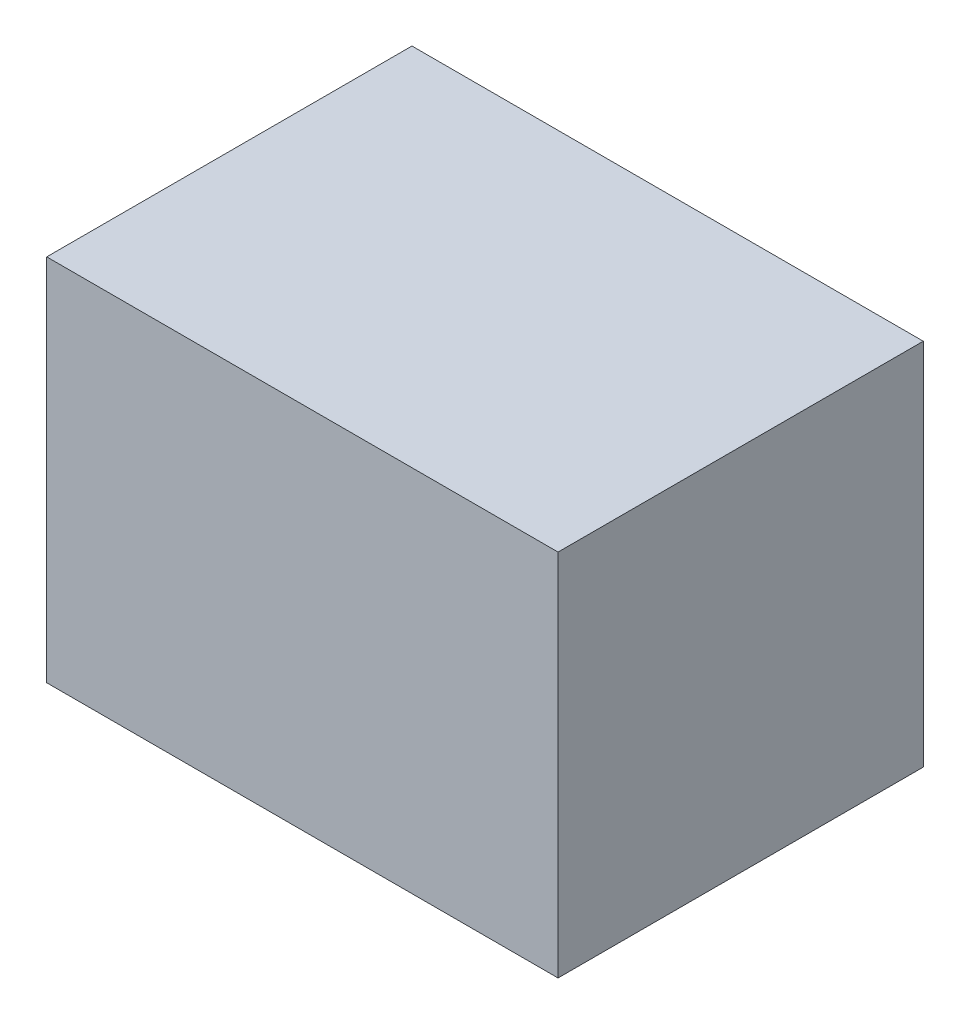
ISO-10303-21;
HEADER;
FILE_DESCRIPTION(('STEP AP214'),'2;1');
FILE_NAME('part.step','',(''),(''),'','','');
FILE_SCHEMA(('AUTOMOTIVE_DESIGN { 1 0 10303 214 1 1 1 1 }'));
ENDSEC;
DATA;
#1=APPLICATION_CONTEXT('core data for automotive mechanical design processes');
#2=APPLICATION_PROTOCOL_DEFINITION('international standard','automotive_design',2000,#1);
#3=PRODUCT_CONTEXT('',#1,'mechanical');
#4=PRODUCT('Part','Part','',(#3));
#5=PRODUCT_RELATED_PRODUCT_CATEGORY('part','',(#4));
#6=PRODUCT_DEFINITION_FORMATION('','',#4);
#7=PRODUCT_DEFINITION_CONTEXT('part definition',#1,'design');
#8=PRODUCT_DEFINITION('design','',#6,#7);
#9=PRODUCT_DEFINITION_SHAPE('','',#8);
#10=(LENGTH_UNIT() NAMED_UNIT(*) SI_UNIT(.MILLI.,.METRE.));
#11=(NAMED_UNIT(*) PLANE_ANGLE_UNIT() SI_UNIT($,.RADIAN.));
#12=(NAMED_UNIT(*) SI_UNIT($,.STERADIAN.) SOLID_ANGLE_UNIT());
#13=UNCERTAINTY_MEASURE_WITH_UNIT(LENGTH_MEASURE(1.E-05),#10,'distance_accuracy_value','');
#14=(GEOMETRIC_REPRESENTATION_CONTEXT(3) GLOBAL_UNCERTAINTY_ASSIGNED_CONTEXT((#13)) GLOBAL_UNIT_ASSIGNED_CONTEXT((#10,
#11,#12)) REPRESENTATION_CONTEXT('',''));
#15=CARTESIAN_POINT('',(0.,0.,0.));
#16=DIRECTION('',(0.,0.,1.));
#17=DIRECTION('',(1.,0.,0.));
#18=AXIS2_PLACEMENT_3D('',#15,#16,#17);
#19=CARTESIAN_POINT('',(70.,50.,100.));
#20=DIRECTION('',(-1.,0.,0.));
#21=DIRECTION('',(0.,-1.,0.));
#22=AXIS2_PLACEMENT_3D('',#19,#20,#21);
#23=PLANE('',#22);
#24=DIRECTION('',(0.,1.,0.));
#25=VECTOR('',#24,1.);
#26=CARTESIAN_POINT('',(70.,50.,0.));
#27=LINE('',#26,#25);
#28=CARTESIAN_POINT('',(70.,-50.,0.));
#29=VERTEX_POINT('',#28);
#30=CARTESIAN_POINT('',(70.,51.,0.));
#31=VERTEX_POINT('',#30);
#32=EDGE_CURVE('E88',#29,#31,#27,.T.);
#33=ORIENTED_EDGE('',*,*,#32,.T.);
#34=DIRECTION('',(0.,0.,-1.));
#35=VECTOR('',#34,1.);
#36=CARTESIAN_POINT('',(70.,51.,0.));
#37=LINE('',#36,#35);
#38=CARTESIAN_POINT('',(70.,51.,100.));
#39=VERTEX_POINT('',#38);
#40=EDGE_CURVE('E135',#39,#31,#37,.T.);
#41=ORIENTED_EDGE('',*,*,#40,.F.);
#42=DIRECTION('',(0.,1.,0.));
#43=VECTOR('',#42,1.);
#44=CARTESIAN_POINT('',(70.,50.,100.));
#45=LINE('',#44,#43);
#46=CARTESIAN_POINT('',(70.,-50.,100.));
#47=VERTEX_POINT('',#46);
#48=EDGE_CURVE('E81',#47,#39,#45,.T.);
#49=ORIENTED_EDGE('',*,*,#48,.F.);
#50=DIRECTION('',(0.,0.,-1.));
#51=VECTOR('',#50,1.);
#52=CARTESIAN_POINT('',(70.,-50.,100.));
#53=LINE('',#52,#51);
#54=EDGE_CURVE('E45',#47,#29,#53,.T.);
#55=ORIENTED_EDGE('',*,*,#54,.T.);
#56=EDGE_LOOP('',(#33,#41,#49,#55));
#57=FACE_BOUND('',#56,.T.);
#58=ADVANCED_FACE('F37',(#57),#23,.F.);
#59=CARTESIAN_POINT('',(-70.,50.,100.));
#60=DIRECTION('',(1.,0.,0.));
#61=DIRECTION('',(0.,1.,0.));
#62=AXIS2_PLACEMENT_3D('',#59,#60,#61);
#63=PLANE('',#62);
#64=DIRECTION('',(0.,-1.,0.));
#65=VECTOR('',#64,1.);
#66=CARTESIAN_POINT('',(-70.,50.,0.));
#67=LINE('',#66,#65);
#68=CARTESIAN_POINT('',(-70.,51.,0.));
#69=VERTEX_POINT('',#68);
#70=CARTESIAN_POINT('',(-70.,-50.,0.));
#71=VERTEX_POINT('',#70);
#72=EDGE_CURVE('E82',#69,#71,#67,.T.);
#73=ORIENTED_EDGE('',*,*,#72,.T.);
#74=DIRECTION('',(0.,0.,-1.));
#75=VECTOR('',#74,1.);
#76=CARTESIAN_POINT('',(-70.,-50.,100.));
#77=LINE('',#76,#75);
#78=CARTESIAN_POINT('',(-70.,-50.,100.));
#79=VERTEX_POINT('',#78);
#80=EDGE_CURVE('E11',#79,#71,#77,.T.);
#81=ORIENTED_EDGE('',*,*,#80,.F.);
#82=DIRECTION('',(0.,-1.,0.));
#83=VECTOR('',#82,1.);
#84=CARTESIAN_POINT('',(-70.,50.,100.));
#85=LINE('',#84,#83);
#86=CARTESIAN_POINT('',(-70.,51.,100.));
#87=VERTEX_POINT('',#86);
#88=EDGE_CURVE('E101',#87,#79,#85,.T.);
#89=ORIENTED_EDGE('',*,*,#88,.F.);
#90=DIRECTION('',(0.,0.,1.));
#91=VECTOR('',#90,1.);
#92=CARTESIAN_POINT('',(-70.,51.,0.));
#93=LINE('',#92,#91);
#94=EDGE_CURVE('E140',#69,#87,#93,.T.);
#95=ORIENTED_EDGE('',*,*,#94,.F.);
#96=EDGE_LOOP('',(#73,#81,#89,#95));
#97=FACE_BOUND('',#96,.T.);
#98=ADVANCED_FACE('F152',(#97),#63,.F.);
#99=CARTESIAN_POINT('',(-70.,-50.,100.));
#100=DIRECTION('',(0.,1.,0.));
#101=DIRECTION('',(0.,0.,1.));
#102=AXIS2_PLACEMENT_3D('',#99,#100,#101);
#103=PLANE('',#102);
#104=DIRECTION('',(1.,0.,0.));
#105=VECTOR('',#104,1.);
#106=CARTESIAN_POINT('',(-70.,-50.,0.));
#107=LINE('',#106,#105);
#108=EDGE_CURVE('E73',#71,#29,#107,.T.);
#109=ORIENTED_EDGE('',*,*,#108,.T.);
#110=ORIENTED_EDGE('',*,*,#54,.F.);
#111=DIRECTION('',(1.,0.,0.));
#112=VECTOR('',#111,1.);
#113=CARTESIAN_POINT('',(-70.,-50.,100.));
#114=LINE('',#113,#112);
#115=EDGE_CURVE('E61',#79,#47,#114,.T.);
#116=ORIENTED_EDGE('',*,*,#115,.F.);
#117=ORIENTED_EDGE('',*,*,#80,.T.);
#118=EDGE_LOOP('',(#109,#110,#116,#117));
#119=FACE_BOUND('',#118,.T.);
#120=ADVANCED_FACE('F75',(#119),#103,.F.);
#121=CARTESIAN_POINT('',(0.,0.,100.));
#122=DIRECTION('',(0.,0.,1.));
#123=DIRECTION('',(1.,0.,0.));
#124=AXIS2_PLACEMENT_3D('',#121,#122,#123);
#125=PLANE('',#124);
#126=ORIENTED_EDGE('',*,*,#48,.T.);
#127=DIRECTION('',(1.,0.,0.));
#128=VECTOR('',#127,1.);
#129=CARTESIAN_POINT('',(-70.,51.,100.));
#130=LINE('',#129,#128);
#131=EDGE_CURVE('E137',#87,#39,#130,.T.);
#132=ORIENTED_EDGE('',*,*,#131,.F.);
#133=ORIENTED_EDGE('',*,*,#88,.T.);
#134=ORIENTED_EDGE('',*,*,#115,.T.);
#135=EDGE_LOOP('',(#126,#132,#133,#134));
#136=FACE_BOUND('',#135,.T.);
#137=ADVANCED_FACE('F203',(#136),#125,.T.);
#138=CARTESIAN_POINT('',(0.,0.,0.));
#139=DIRECTION('',(0.,0.,1.));
#140=DIRECTION('',(1.,0.,0.));
#141=AXIS2_PLACEMENT_3D('',#138,#139,#140);
#142=PLANE('',#141);
#143=ORIENTED_EDGE('',*,*,#32,.F.);
#144=ORIENTED_EDGE('',*,*,#108,.F.);
#145=ORIENTED_EDGE('',*,*,#72,.F.);
#146=DIRECTION('',(-1.,0.,0.));
#147=VECTOR('',#146,1.);
#148=CARTESIAN_POINT('',(-70.,51.,0.));
#149=LINE('',#148,#147);
#150=EDGE_CURVE('E93',#31,#69,#149,.T.);
#151=ORIENTED_EDGE('',*,*,#150,.F.);
#152=EDGE_LOOP('',(#143,#144,#145,#151));
#153=FACE_BOUND('',#152,.T.);
#154=ADVANCED_FACE('F91',(#153),#142,.F.);
#155=CARTESIAN_POINT('',(0.,51.,0.));
#156=DIRECTION('',(0.,1.,0.));
#157=DIRECTION('',(0.,0.,1.));
#158=AXIS2_PLACEMENT_3D('',#155,#156,#157);
#159=PLANE('',#158);
#160=ORIENTED_EDGE('',*,*,#94,.T.);
#161=ORIENTED_EDGE('',*,*,#131,.T.);
#162=ORIENTED_EDGE('',*,*,#40,.T.);
#163=ORIENTED_EDGE('',*,*,#150,.T.);
#164=EDGE_LOOP('',(#160,#161,#162,#163));
#165=FACE_BOUND('',#164,.T.);
#166=ADVANCED_FACE('F145',(#165),#159,.T.);
#167=CLOSED_SHELL('',(#58,#98,#120,#137,#154,#166));
#168=CARTESIAN_POINT('',(0.,50.,0.));
#169=DIRECTION('',(0.,1.,0.));
#170=DIRECTION('',(0.,0.,1.));
#171=AXIS2_PLACEMENT_3D('',#168,#169,#170);
#172=PLANE('',#171);
#173=DIRECTION('',(-1.,0.,0.));
#174=VECTOR('',#173,1.);
#175=CARTESIAN_POINT('',(-70.,50.,1.));
#176=LINE('',#175,#174);
#177=CARTESIAN_POINT('',(69.,50.,1.));
#178=VERTEX_POINT('',#177);
#179=CARTESIAN_POINT('',(-69.,50.,1.));
#180=VERTEX_POINT('',#179);
#181=EDGE_CURVE('E111',#178,#180,#176,.T.);
#182=ORIENTED_EDGE('',*,*,#181,.F.);
#183=DIRECTION('',(0.,0.,-1.));
#184=VECTOR('',#183,1.);
#185=CARTESIAN_POINT('',(69.,50.,100.));
#186=LINE('',#185,#184);
#187=CARTESIAN_POINT('',(69.,50.,99.));
#188=VERTEX_POINT('',#187);
#189=EDGE_CURVE('E94',#188,#178,#186,.T.);
#190=ORIENTED_EDGE('',*,*,#189,.F.);
#191=DIRECTION('',(-1.,0.,0.));
#192=VECTOR('',#191,1.);
#193=CARTESIAN_POINT('',(-70.,50.,99.));
#194=LINE('',#193,#192);
#195=CARTESIAN_POINT('',(-69.,50.,99.));
#196=VERTEX_POINT('',#195);
#197=EDGE_CURVE('E104',#188,#196,#194,.T.);
#198=ORIENTED_EDGE('',*,*,#197,.T.);
#199=DIRECTION('',(0.,0.,-1.));
#200=VECTOR('',#199,1.);
#201=CARTESIAN_POINT('',(-69.,50.,100.));
#202=LINE('',#201,#200);
#203=EDGE_CURVE('E97',#196,#180,#202,.T.);
#204=ORIENTED_EDGE('',*,*,#203,.T.);
#205=EDGE_LOOP('',(#182,#190,#198,#204));
#206=FACE_BOUND('',#205,.T.);
#207=ADVANCED_FACE('F180',(#206),#172,.F.);
#208=CARTESIAN_POINT('',(-70.,-49.,100.));
#209=DIRECTION('',(0.,1.,0.));
#210=DIRECTION('',(0.,0.,1.));
#211=AXIS2_PLACEMENT_3D('',#208,#209,#210);
#212=PLANE('',#211);
#213=DIRECTION('',(1.,0.,0.));
#214=VECTOR('',#213,1.);
#215=CARTESIAN_POINT('',(-70.,-49.,1.));
#216=LINE('',#215,#214);
#217=CARTESIAN_POINT('',(-69.,-49.,1.));
#218=VERTEX_POINT('',#217);
#219=CARTESIAN_POINT('',(69.,-49.,1.));
#220=VERTEX_POINT('',#219);
#221=EDGE_CURVE('E121',#218,#220,#216,.T.);
#222=ORIENTED_EDGE('',*,*,#221,.F.);
#223=DIRECTION('',(0.,0.,-1.));
#224=VECTOR('',#223,1.);
#225=CARTESIAN_POINT('',(-69.,-49.,100.));
#226=LINE('',#225,#224);
#227=CARTESIAN_POINT('',(-69.,-49.,99.));
#228=VERTEX_POINT('',#227);
#229=EDGE_CURVE('E110',#228,#218,#226,.T.);
#230=ORIENTED_EDGE('',*,*,#229,.F.);
#231=DIRECTION('',(1.,0.,0.));
#232=VECTOR('',#231,1.);
#233=CARTESIAN_POINT('',(-70.,-49.,99.));
#234=LINE('',#233,#232);
#235=CARTESIAN_POINT('',(69.,-49.,99.));
#236=VERTEX_POINT('',#235);
#237=EDGE_CURVE('E118',#228,#236,#234,.T.);
#238=ORIENTED_EDGE('',*,*,#237,.T.);
#239=DIRECTION('',(0.,0.,-1.));
#240=VECTOR('',#239,1.);
#241=CARTESIAN_POINT('',(69.,-49.,100.));
#242=LINE('',#241,#240);
#243=EDGE_CURVE('E124',#236,#220,#242,.T.);
#244=ORIENTED_EDGE('',*,*,#243,.T.);
#245=EDGE_LOOP('',(#222,#230,#238,#244));
#246=FACE_BOUND('',#245,.T.);
#247=ADVANCED_FACE('F187',(#246),#212,.T.);
#248=CARTESIAN_POINT('',(-69.,50.,100.));
#249=DIRECTION('',(1.,0.,0.));
#250=DIRECTION('',(0.,1.,0.));
#251=AXIS2_PLACEMENT_3D('',#248,#249,#250);
#252=PLANE('',#251);
#253=DIRECTION('',(0.,-1.,0.));
#254=VECTOR('',#253,1.);
#255=CARTESIAN_POINT('',(-69.,50.,1.));
#256=LINE('',#255,#254);
#257=EDGE_CURVE('E113',#180,#218,#256,.T.);
#258=ORIENTED_EDGE('',*,*,#257,.F.);
#259=ORIENTED_EDGE('',*,*,#203,.F.);
#260=DIRECTION('',(0.,-1.,0.));
#261=VECTOR('',#260,1.);
#262=CARTESIAN_POINT('',(-69.,50.,99.));
#263=LINE('',#262,#261);
#264=EDGE_CURVE('E107',#196,#228,#263,.T.);
#265=ORIENTED_EDGE('',*,*,#264,.T.);
#266=ORIENTED_EDGE('',*,*,#229,.T.);
#267=EDGE_LOOP('',(#258,#259,#265,#266));
#268=FACE_BOUND('',#267,.T.);
#269=ADVANCED_FACE('F172',(#268),#252,.T.);
#270=CARTESIAN_POINT('',(0.,0.,99.));
#271=DIRECTION('',(0.,0.,1.));
#272=DIRECTION('',(1.,0.,0.));
#273=AXIS2_PLACEMENT_3D('',#270,#271,#272);
#274=PLANE('',#273);
#275=DIRECTION('',(0.,1.,0.));
#276=VECTOR('',#275,1.);
#277=CARTESIAN_POINT('',(69.,50.,99.));
#278=LINE('',#277,#276);
#279=EDGE_CURVE('E52',#236,#188,#278,.T.);
#280=ORIENTED_EDGE('',*,*,#279,.F.);
#281=ORIENTED_EDGE('',*,*,#237,.F.);
#282=ORIENTED_EDGE('',*,*,#264,.F.);
#283=ORIENTED_EDGE('',*,*,#197,.F.);
#284=EDGE_LOOP('',(#280,#281,#282,#283));
#285=FACE_BOUND('',#284,.T.);
#286=ADVANCED_FACE('F178',(#285),#274,.F.);
#287=CARTESIAN_POINT('',(69.,50.,100.));
#288=DIRECTION('',(-1.,0.,0.));
#289=DIRECTION('',(0.,-1.,0.));
#290=AXIS2_PLACEMENT_3D('',#287,#288,#289);
#291=PLANE('',#290);
#292=DIRECTION('',(0.,1.,0.));
#293=VECTOR('',#292,1.);
#294=CARTESIAN_POINT('',(69.,50.,1.));
#295=LINE('',#294,#293);
#296=EDGE_CURVE('E114',#220,#178,#295,.T.);
#297=ORIENTED_EDGE('',*,*,#296,.F.);
#298=ORIENTED_EDGE('',*,*,#243,.F.);
#299=ORIENTED_EDGE('',*,*,#279,.T.);
#300=ORIENTED_EDGE('',*,*,#189,.T.);
#301=EDGE_LOOP('',(#297,#298,#299,#300));
#302=FACE_BOUND('',#301,.T.);
#303=ADVANCED_FACE('F182',(#302),#291,.T.);
#304=CARTESIAN_POINT('',(0.,0.,1.));
#305=DIRECTION('',(0.,0.,1.));
#306=DIRECTION('',(1.,0.,0.));
#307=AXIS2_PLACEMENT_3D('',#304,#305,#306);
#308=PLANE('',#307);
#309=ORIENTED_EDGE('',*,*,#296,.T.);
#310=ORIENTED_EDGE('',*,*,#181,.T.);
#311=ORIENTED_EDGE('',*,*,#257,.T.);
#312=ORIENTED_EDGE('',*,*,#221,.T.);
#313=EDGE_LOOP('',(#309,#310,#311,#312));
#314=FACE_BOUND('',#313,.T.);
#315=ADVANCED_FACE('F184',(#314),#308,.T.);
#316=CLOSED_SHELL('',(#207,#247,#269,#286,#303,#315));
#317=ORIENTED_CLOSED_SHELL('',*,#316,.T.);
#318=BREP_WITH_VOIDS('B2',#167,(#317));
#319=ADVANCED_BREP_SHAPE_REPRESENTATION('',(#18,#318),#14);
#320=SHAPE_DEFINITION_REPRESENTATION(#9,#319);
ENDSEC;
END-ISO-10303-21;
